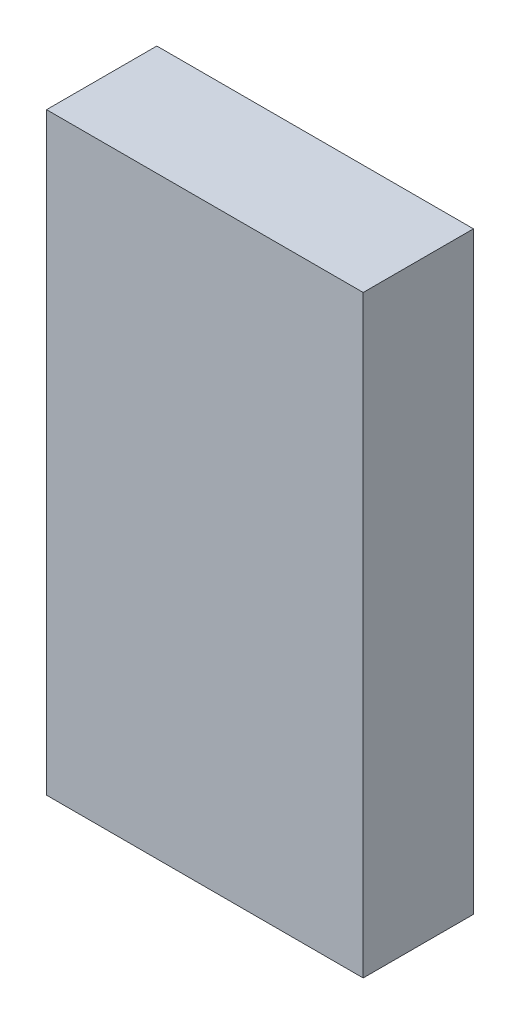
ISO-10303-21;
HEADER;
FILE_DESCRIPTION(('STEP AP214'),'2;1');
FILE_NAME('part.step','',(''),(''),'','','');
FILE_SCHEMA(('AUTOMOTIVE_DESIGN { 1 0 10303 214 1 1 1 1 }'));
ENDSEC;
DATA;
#1=APPLICATION_CONTEXT('core data for automotive mechanical design processes');
#2=APPLICATION_PROTOCOL_DEFINITION('international standard','automotive_design',2000,#1);
#3=PRODUCT_CONTEXT('',#1,'mechanical');
#4=PRODUCT('Part','Part','',(#3));
#5=PRODUCT_RELATED_PRODUCT_CATEGORY('part','',(#4));
#6=PRODUCT_DEFINITION_FORMATION('','',#4);
#7=PRODUCT_DEFINITION_CONTEXT('part definition',#1,'design');
#8=PRODUCT_DEFINITION('design','',#6,#7);
#9=PRODUCT_DEFINITION_SHAPE('','',#8);
#10=(LENGTH_UNIT() NAMED_UNIT(*) SI_UNIT(.MILLI.,.METRE.));
#11=(NAMED_UNIT(*) PLANE_ANGLE_UNIT() SI_UNIT($,.RADIAN.));
#12=(NAMED_UNIT(*) SI_UNIT($,.STERADIAN.) SOLID_ANGLE_UNIT());
#13=UNCERTAINTY_MEASURE_WITH_UNIT(LENGTH_MEASURE(1.E-05),#10,'distance_accuracy_value','');
#14=(GEOMETRIC_REPRESENTATION_CONTEXT(3) GLOBAL_UNCERTAINTY_ASSIGNED_CONTEXT((#13)) GLOBAL_UNIT_ASSIGNED_CONTEXT((#10,
#11,#12)) REPRESENTATION_CONTEXT('',''));
#15=CARTESIAN_POINT('',(0.,0.,0.));
#16=DIRECTION('',(0.,0.,1.));
#17=DIRECTION('',(1.,0.,0.));
#18=AXIS2_PLACEMENT_3D('',#15,#16,#17);
#19=CARTESIAN_POINT('',(-2.79999948,-5.24999966,1.95));
#20=DIRECTION('',(0.,0.,1.));
#21=DIRECTION('',(1.,0.,0.));
#22=AXIS2_PLACEMENT_3D('',#19,#20,#21);
#23=PLANE('',#22);
#24=DIRECTION('',(1.,0.,0.));
#25=VECTOR('',#24,1.);
#26=CARTESIAN_POINT('',(-2.79999948,5.24999966,1.95));
#27=LINE('',#26,#25);
#28=CARTESIAN_POINT('',(-2.79999948,5.24999966,1.95));
#29=VERTEX_POINT('',#28);
#30=CARTESIAN_POINT('',(2.79999948,5.24999966,1.95));
#31=VERTEX_POINT('',#30);
#32=EDGE_CURVE('E53',#29,#31,#27,.T.);
#33=ORIENTED_EDGE('',*,*,#32,.F.);
#34=DIRECTION('',(0.,1.,0.));
#35=VECTOR('',#34,1.);
#36=CARTESIAN_POINT('',(-2.79999948,-5.24999966,1.95));
#37=LINE('',#36,#35);
#38=CARTESIAN_POINT('',(-2.79999948,-5.24999966,1.95));
#39=VERTEX_POINT('',#38);
#40=EDGE_CURVE('E68',#39,#29,#37,.T.);
#41=ORIENTED_EDGE('',*,*,#40,.F.);
#42=DIRECTION('',(1.,0.,0.));
#43=VECTOR('',#42,1.);
#44=CARTESIAN_POINT('',(2.79999948,-5.24999966,1.95));
#45=LINE('',#44,#43);
#46=CARTESIAN_POINT('',(2.79999948,-5.24999966,1.95));
#47=VERTEX_POINT('',#46);
#48=EDGE_CURVE('E20',#47,#39,#45,.F.);
#49=ORIENTED_EDGE('',*,*,#48,.F.);
#50=DIRECTION('',(0.,1.,0.));
#51=VECTOR('',#50,1.);
#52=CARTESIAN_POINT('',(2.79999948,5.24999966,1.95));
#53=LINE('',#52,#51);
#54=EDGE_CURVE('E58',#31,#47,#53,.F.);
#55=ORIENTED_EDGE('',*,*,#54,.F.);
#56=EDGE_LOOP('',(#33,#41,#49,#55));
#57=FACE_BOUND('',#56,.T.);
#58=ADVANCED_FACE('F17',(#57),#23,.T.);
#59=CARTESIAN_POINT('',(2.79999948,-5.24999966,0.));
#60=DIRECTION('',(0.,-1.,0.));
#61=DIRECTION('',(0.,0.,-1.));
#62=AXIS2_PLACEMENT_3D('',#59,#60,#61);
#63=PLANE('',#62);
#64=DIRECTION('',(0.,0.,1.));
#65=VECTOR('',#64,1.);
#66=CARTESIAN_POINT('',(-2.79999948,-5.24999966,0.));
#67=LINE('',#66,#65);
#68=CARTESIAN_POINT('',(-2.79999948,-5.24999966,0.));
#69=VERTEX_POINT('',#68);
#70=EDGE_CURVE('E79',#69,#39,#67,.T.);
#71=ORIENTED_EDGE('',*,*,#70,.F.);
#72=DIRECTION('',(1.,0.,0.));
#73=VECTOR('',#72,1.);
#74=CARTESIAN_POINT('',(-2.79999948,-5.24999966,0.));
#75=LINE('',#74,#73);
#76=CARTESIAN_POINT('',(2.79999948,-5.24999966,0.));
#77=VERTEX_POINT('',#76);
#78=EDGE_CURVE('E74',#69,#77,#75,.T.);
#79=ORIENTED_EDGE('',*,*,#78,.T.);
#80=DIRECTION('',(0.,0.,-1.));
#81=VECTOR('',#80,1.);
#82=CARTESIAN_POINT('',(2.79999948,-5.24999966,0.));
#83=LINE('',#82,#81);
#84=EDGE_CURVE('E63',#47,#77,#83,.T.);
#85=ORIENTED_EDGE('',*,*,#84,.F.);
#86=ORIENTED_EDGE('',*,*,#48,.T.);
#87=EDGE_LOOP('',(#71,#79,#85,#86));
#88=FACE_BOUND('',#87,.T.);
#89=ADVANCED_FACE('F73',(#88),#63,.T.);
#90=CARTESIAN_POINT('',(2.79999948,5.24999966,0.));
#91=DIRECTION('',(1.,0.,0.));
#92=DIRECTION('',(0.,0.,-1.));
#93=AXIS2_PLACEMENT_3D('',#90,#91,#92);
#94=PLANE('',#93);
#95=ORIENTED_EDGE('',*,*,#84,.T.);
#96=DIRECTION('',(0.,1.,0.));
#97=VECTOR('',#96,1.);
#98=CARTESIAN_POINT('',(2.79999948,-5.24999966,0.));
#99=LINE('',#98,#97);
#100=CARTESIAN_POINT('',(2.79999948,5.24999966,0.));
#101=VERTEX_POINT('',#100);
#102=EDGE_CURVE('E84',#77,#101,#99,.T.);
#103=ORIENTED_EDGE('',*,*,#102,.T.);
#104=DIRECTION('',(0.,0.,1.));
#105=VECTOR('',#104,1.);
#106=CARTESIAN_POINT('',(2.79999948,5.24999966,0.));
#107=LINE('',#106,#105);
#108=EDGE_CURVE('E65',#31,#101,#107,.F.);
#109=ORIENTED_EDGE('',*,*,#108,.F.);
#110=ORIENTED_EDGE('',*,*,#54,.T.);
#111=EDGE_LOOP('',(#95,#103,#109,#110));
#112=FACE_BOUND('',#111,.T.);
#113=ADVANCED_FACE('F60',(#112),#94,.T.);
#114=CARTESIAN_POINT('',(-2.79999948,5.24999966,0.));
#115=DIRECTION('',(0.,1.,0.));
#116=DIRECTION('',(0.,0.,1.));
#117=AXIS2_PLACEMENT_3D('',#114,#115,#116);
#118=PLANE('',#117);
#119=ORIENTED_EDGE('',*,*,#108,.T.);
#120=DIRECTION('',(1.,0.,0.));
#121=VECTOR('',#120,1.);
#122=CARTESIAN_POINT('',(-2.79999948,5.24999966,0.));
#123=LINE('',#122,#121);
#124=CARTESIAN_POINT('',(-2.79999948,5.24999966,0.));
#125=VERTEX_POINT('',#124);
#126=EDGE_CURVE('E26',#101,#125,#123,.F.);
#127=ORIENTED_EDGE('',*,*,#126,.T.);
#128=DIRECTION('',(0.,0.,1.));
#129=VECTOR('',#128,1.);
#130=CARTESIAN_POINT('',(-2.79999948,5.24999966,0.));
#131=LINE('',#130,#129);
#132=EDGE_CURVE('E34',#29,#125,#131,.F.);
#133=ORIENTED_EDGE('',*,*,#132,.F.);
#134=ORIENTED_EDGE('',*,*,#32,.T.);
#135=EDGE_LOOP('',(#119,#127,#133,#134));
#136=FACE_BOUND('',#135,.T.);
#137=ADVANCED_FACE('F88',(#136),#118,.T.);
#138=CARTESIAN_POINT('',(-2.79999948,-5.24999966,0.));
#139=DIRECTION('',(-1.,0.,0.));
#140=DIRECTION('',(0.,0.,1.));
#141=AXIS2_PLACEMENT_3D('',#138,#139,#140);
#142=PLANE('',#141);
#143=ORIENTED_EDGE('',*,*,#132,.T.);
#144=DIRECTION('',(0.,1.,0.));
#145=VECTOR('',#144,1.);
#146=CARTESIAN_POINT('',(-2.79999948,-5.24999966,0.));
#147=LINE('',#146,#145);
#148=EDGE_CURVE('E11',#125,#69,#147,.F.);
#149=ORIENTED_EDGE('',*,*,#148,.T.);
#150=ORIENTED_EDGE('',*,*,#70,.T.);
#151=ORIENTED_EDGE('',*,*,#40,.T.);
#152=EDGE_LOOP('',(#143,#149,#150,#151));
#153=FACE_BOUND('',#152,.T.);
#154=ADVANCED_FACE('F91',(#153),#142,.T.);
#155=CARTESIAN_POINT('',(-2.79999948,-5.24999966,0.));
#156=DIRECTION('',(0.,0.,1.));
#157=DIRECTION('',(1.,0.,0.));
#158=AXIS2_PLACEMENT_3D('',#155,#156,#157);
#159=PLANE('',#158);
#160=ORIENTED_EDGE('',*,*,#126,.F.);
#161=ORIENTED_EDGE('',*,*,#102,.F.);
#162=ORIENTED_EDGE('',*,*,#78,.F.);
#163=ORIENTED_EDGE('',*,*,#148,.F.);
#164=EDGE_LOOP('',(#160,#161,#162,#163));
#165=FACE_BOUND('',#164,.T.);
#166=ADVANCED_FACE('F90',(#165),#159,.F.);
#167=CLOSED_SHELL('',(#58,#89,#113,#137,#154,#166));
#168=MANIFOLD_SOLID_BREP('B1',#167);
#169=ADVANCED_BREP_SHAPE_REPRESENTATION('',(#18,#168),#14);
#170=SHAPE_DEFINITION_REPRESENTATION(#9,#169);
ENDSEC;
END-ISO-10303-21;
